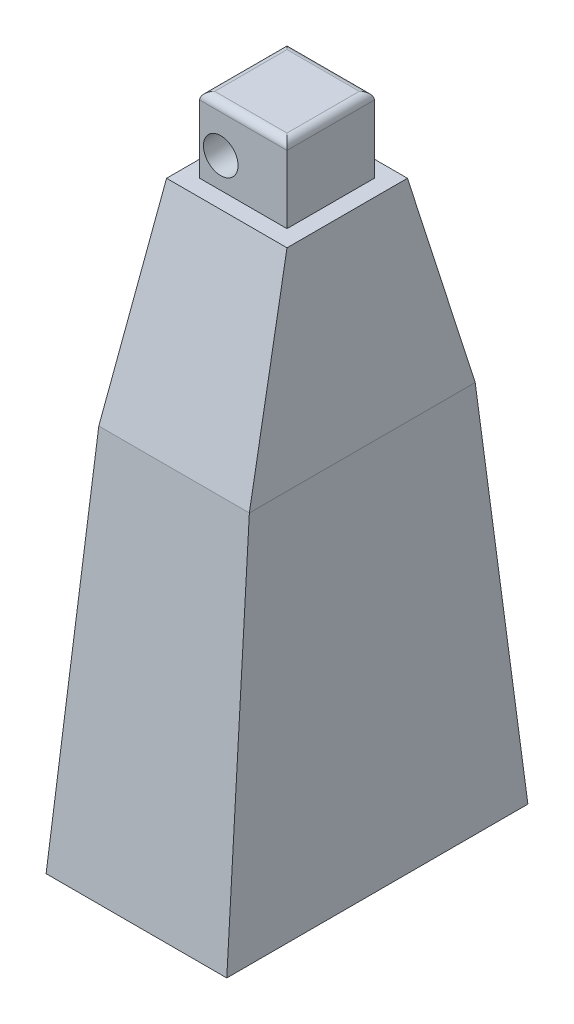
ISO-10303-21;
HEADER;
FILE_DESCRIPTION(('STEP AP214'),'2;1');
FILE_NAME('part.step','',(''),(''),'','','');
FILE_SCHEMA(('AUTOMOTIVE_DESIGN { 1 0 10303 214 1 1 1 1 }'));
ENDSEC;
DATA;
#1=APPLICATION_CONTEXT('core data for automotive mechanical design processes');
#2=APPLICATION_PROTOCOL_DEFINITION('international standard','automotive_design',2000,#1);
#3=PRODUCT_CONTEXT('',#1,'mechanical');
#4=PRODUCT('Part','Part','',(#3));
#5=PRODUCT_RELATED_PRODUCT_CATEGORY('part','',(#4));
#6=PRODUCT_DEFINITION_FORMATION('','',#4);
#7=PRODUCT_DEFINITION_CONTEXT('part definition',#1,'design');
#8=PRODUCT_DEFINITION('design','',#6,#7);
#9=PRODUCT_DEFINITION_SHAPE('','',#8);
#10=(LENGTH_UNIT() NAMED_UNIT(*) SI_UNIT(.MILLI.,.METRE.));
#11=(NAMED_UNIT(*) PLANE_ANGLE_UNIT() SI_UNIT($,.RADIAN.));
#12=(NAMED_UNIT(*) SI_UNIT($,.STERADIAN.) SOLID_ANGLE_UNIT());
#13=UNCERTAINTY_MEASURE_WITH_UNIT(LENGTH_MEASURE(1.E-05),#10,'distance_accuracy_value','');
#14=(GEOMETRIC_REPRESENTATION_CONTEXT(3) GLOBAL_UNCERTAINTY_ASSIGNED_CONTEXT((#13)) GLOBAL_UNIT_ASSIGNED_CONTEXT((#10,
#11,#12)) REPRESENTATION_CONTEXT('',''));
#15=CARTESIAN_POINT('',(0.,0.,0.));
#16=DIRECTION('',(0.,0.,1.));
#17=DIRECTION('',(1.,0.,0.));
#18=AXIS2_PLACEMENT_3D('',#15,#16,#17);
#19=CARTESIAN_POINT('',(0.,76.,0.));
#20=DIRECTION('',(0.,-1.,0.));
#21=DIRECTION('',(0.,0.,-1.));
#22=AXIS2_PLACEMENT_3D('',#19,#20,#21);
#23=PLANE('',#22);
#24=DIRECTION('',(0.,0.,1.));
#25=VECTOR('',#24,1.);
#26=CARTESIAN_POINT('',(-8.,76.,-8.));
#27=LINE('',#26,#25);
#28=CARTESIAN_POINT('',(-8.,76.,-8.));
#29=VERTEX_POINT('',#28);
#30=CARTESIAN_POINT('',(-8.,76.,8.));
#31=VERTEX_POINT('',#30);
#32=EDGE_CURVE('E261',#29,#31,#27,.T.);
#33=ORIENTED_EDGE('',*,*,#32,.T.);
#34=DIRECTION('',(1.,0.,0.));
#35=VECTOR('',#34,1.);
#36=CARTESIAN_POINT('',(8.,76.,8.));
#37=LINE('',#36,#35);
#38=CARTESIAN_POINT('',(8.,76.,8.));
#39=VERTEX_POINT('',#38);
#40=EDGE_CURVE('E309',#31,#39,#37,.T.);
#41=ORIENTED_EDGE('',*,*,#40,.T.);
#42=DIRECTION('',(0.,0.,-1.));
#43=VECTOR('',#42,1.);
#44=CARTESIAN_POINT('',(8.,76.,-8.));
#45=LINE('',#44,#43);
#46=CARTESIAN_POINT('',(8.,76.,-8.));
#47=VERTEX_POINT('',#46);
#48=EDGE_CURVE('E321',#39,#47,#45,.T.);
#49=ORIENTED_EDGE('',*,*,#48,.T.);
#50=DIRECTION('',(-1.,0.,0.));
#51=VECTOR('',#50,1.);
#52=CARTESIAN_POINT('',(8.,76.,-8.));
#53=LINE('',#52,#51);
#54=EDGE_CURVE('E268',#47,#29,#53,.T.);
#55=ORIENTED_EDGE('',*,*,#54,.T.);
#56=EDGE_LOOP('',(#33,#41,#49,#55));
#57=FACE_BOUND('',#56,.T.);
#58=DIRECTION('',(1.,0.,0.));
#59=VECTOR('',#58,1.);
#60=CARTESIAN_POINT('',(-5.8,76.,5.8));
#61=LINE('',#60,#59);
#62=CARTESIAN_POINT('',(-5.8,76.,5.8));
#63=VERTEX_POINT('',#62);
#64=CARTESIAN_POINT('',(5.8,76.,5.8));
#65=VERTEX_POINT('',#64);
#66=EDGE_CURVE('E222',#63,#65,#61,.T.);
#67=ORIENTED_EDGE('',*,*,#66,.F.);
#68=DIRECTION('',(0.,0.,1.));
#69=VECTOR('',#68,1.);
#70=CARTESIAN_POINT('',(-5.8,76.,-5.8));
#71=LINE('',#70,#69);
#72=CARTESIAN_POINT('',(-5.8,76.,-5.8));
#73=VERTEX_POINT('',#72);
#74=EDGE_CURVE('E233',#73,#63,#71,.T.);
#75=ORIENTED_EDGE('',*,*,#74,.F.);
#76=DIRECTION('',(-1.,0.,0.));
#77=VECTOR('',#76,1.);
#78=CARTESIAN_POINT('',(5.8,76.,-5.8));
#79=LINE('',#78,#77);
#80=CARTESIAN_POINT('',(5.8,76.,-5.8));
#81=VERTEX_POINT('',#80);
#82=EDGE_CURVE('E230',#81,#73,#79,.T.);
#83=ORIENTED_EDGE('',*,*,#82,.F.);
#84=DIRECTION('',(0.,0.,-1.));
#85=VECTOR('',#84,1.);
#86=CARTESIAN_POINT('',(5.8,76.,5.8));
#87=LINE('',#86,#85);
#88=EDGE_CURVE('E227',#65,#81,#87,.T.);
#89=ORIENTED_EDGE('',*,*,#88,.F.);
#90=EDGE_LOOP('',(#67,#75,#83,#89));
#91=FACE_BOUND('',#90,.T.);
#92=ADVANCED_FACE('F55',(#57,#91),#23,.F.);
#93=CARTESIAN_POINT('',(0.,0.,0.));
#94=DIRECTION('',(0.,1.,0.));
#95=DIRECTION('',(0.,0.,1.));
#96=AXIS2_PLACEMENT_3D('',#93,#94,#95);
#97=PLANE('',#96);
#98=CARTESIAN_POINT('',(0.,0.,16.));
#99=DIRECTION('',(0.,-1.,0.));
#100=DIRECTION('',(0.,0.,-1.));
#101=AXIS2_PLACEMENT_3D('',#98,#99,#100);
#102=CIRCLE('',#101,2.3);
#103=CARTESIAN_POINT('',(0.,0.,13.7));
#104=VERTEX_POINT('',#103);
#105=EDGE_CURVE('E863',#104,#104,#102,.T.);
#106=ORIENTED_EDGE('',*,*,#105,.F.);
#107=EDGE_LOOP('',(#106));
#108=FACE_BOUND('',#107,.T.);
#109=CARTESIAN_POINT('',(0.,0.,-16.));
#110=DIRECTION('',(0.,-1.,0.));
#111=DIRECTION('',(0.,0.,1.));
#112=AXIS2_PLACEMENT_3D('',#109,#110,#111);
#113=CIRCLE('',#112,2.3);
#114=CARTESIAN_POINT('',(0.,0.,-13.7));
#115=VERTEX_POINT('',#114);
#116=EDGE_CURVE('E195',#115,#115,#113,.T.);
#117=ORIENTED_EDGE('',*,*,#116,.F.);
#118=EDGE_LOOP('',(#117));
#119=FACE_BOUND('',#118,.T.);
#120=DIRECTION('',(1.,0.,0.));
#121=VECTOR('',#120,1.);
#122=CARTESIAN_POINT('',(-4.2,0.,-12.2));
#123=LINE('',#122,#121);
#124=CARTESIAN_POINT('',(-4.2,0.,-12.2));
#125=VERTEX_POINT('',#124);
#126=CARTESIAN_POINT('',(4.2,0.,-12.2));
#127=VERTEX_POINT('',#126);
#128=EDGE_CURVE('E201',#125,#127,#123,.T.);
#129=ORIENTED_EDGE('',*,*,#128,.F.);
#130=DIRECTION('',(0.,0.,-1.));
#131=VECTOR('',#130,1.);
#132=CARTESIAN_POINT('',(-4.2,0.,12.2));
#133=LINE('',#132,#131);
#134=CARTESIAN_POINT('',(-4.2,0.,12.2));
#135=VERTEX_POINT('',#134);
#136=EDGE_CURVE('E72',#135,#125,#133,.T.);
#137=ORIENTED_EDGE('',*,*,#136,.F.);
#138=DIRECTION('',(-1.,0.,0.));
#139=VECTOR('',#138,1.);
#140=CARTESIAN_POINT('',(4.2,0.,12.2));
#141=LINE('',#140,#139);
#142=CARTESIAN_POINT('',(4.2,0.,12.2));
#143=VERTEX_POINT('',#142);
#144=EDGE_CURVE('E189',#143,#135,#141,.T.);
#145=ORIENTED_EDGE('',*,*,#144,.F.);
#146=DIRECTION('',(0.,0.,1.));
#147=VECTOR('',#146,1.);
#148=CARTESIAN_POINT('',(4.2,0.,-12.2));
#149=LINE('',#148,#147);
#150=EDGE_CURVE('E192',#127,#143,#149,.T.);
#151=ORIENTED_EDGE('',*,*,#150,.F.);
#152=EDGE_LOOP('',(#129,#137,#145,#151));
#153=FACE_BOUND('',#152,.T.);
#154=DIRECTION('',(0.,0.,-1.));
#155=VECTOR('',#154,1.);
#156=CARTESIAN_POINT('',(12.,0.,-20.));
#157=LINE('',#156,#155);
#158=CARTESIAN_POINT('',(12.,0.,20.));
#159=VERTEX_POINT('',#158);
#160=CARTESIAN_POINT('',(12.,0.,-20.));
#161=VERTEX_POINT('',#160);
#162=EDGE_CURVE('E518',#159,#161,#157,.T.);
#163=ORIENTED_EDGE('',*,*,#162,.F.);
#164=DIRECTION('',(1.,0.,0.));
#165=VECTOR('',#164,1.);
#166=CARTESIAN_POINT('',(-12.,0.,20.));
#167=LINE('',#166,#165);
#168=CARTESIAN_POINT('',(-12.,0.,20.));
#169=VERTEX_POINT('',#168);
#170=EDGE_CURVE('E511',#169,#159,#167,.T.);
#171=ORIENTED_EDGE('',*,*,#170,.F.);
#172=DIRECTION('',(0.,0.,1.));
#173=VECTOR('',#172,1.);
#174=CARTESIAN_POINT('',(-12.,0.,-20.));
#175=LINE('',#174,#173);
#176=CARTESIAN_POINT('',(-12.,0.,-20.));
#177=VERTEX_POINT('',#176);
#178=EDGE_CURVE('E517',#177,#169,#175,.T.);
#179=ORIENTED_EDGE('',*,*,#178,.F.);
#180=DIRECTION('',(-1.,0.,0.));
#181=VECTOR('',#180,1.);
#182=CARTESIAN_POINT('',(-12.,0.,-20.));
#183=LINE('',#182,#181);
#184=EDGE_CURVE('E521',#161,#177,#183,.T.);
#185=ORIENTED_EDGE('',*,*,#184,.F.);
#186=EDGE_LOOP('',(#163,#171,#179,#185));
#187=FACE_BOUND('',#186,.T.);
#188=ADVANCED_FACE('F406',(#108,#119,#153,#187),#97,.F.);
#189=CARTESIAN_POINT('',(0.,1.98019801980198,-19.8019801980198));
#190=DIRECTION('',(0.,-0.099503719020999,0.995037190209989));
#191=DIRECTION('',(0.,-0.995037190209989,-0.099503719020999));
#192=AXIS2_PLACEMENT_3D('',#189,#190,#191);
#193=PLANE('',#192);
#194=DIRECTION('',(0.039769999084793,0.994249977119823,0.0994249977119823));
#195=VECTOR('',#194,1.);
#196=CARTESIAN_POINT('',(-12.,0.,-20.));
#197=LINE('',#196,#195);
#198=CARTESIAN_POINT('',(-10.,50.,-15.));
#199=VERTEX_POINT('',#198);
#200=EDGE_CURVE('E533',#177,#199,#197,.T.);
#201=ORIENTED_EDGE('',*,*,#200,.T.);
#202=DIRECTION('',(-1.,0.,0.));
#203=VECTOR('',#202,1.);
#204=CARTESIAN_POINT('',(10.,50.,-15.));
#205=LINE('',#204,#203);
#206=CARTESIAN_POINT('',(10.,50.,-15.));
#207=VERTEX_POINT('',#206);
#208=EDGE_CURVE('E457',#207,#199,#205,.T.);
#209=ORIENTED_EDGE('',*,*,#208,.F.);
#210=DIRECTION('',(-0.0397699990847928,0.994249977119823,0.0994249977119823));
#211=VECTOR('',#210,1.);
#212=CARTESIAN_POINT('',(12.,0.,-20.));
#213=LINE('',#212,#211);
#214=EDGE_CURVE('E539',#161,#207,#213,.T.);
#215=ORIENTED_EDGE('',*,*,#214,.F.);
#216=ORIENTED_EDGE('',*,*,#184,.T.);
#217=EDGE_LOOP('',(#201,#209,#215,#216));
#218=FACE_BOUND('',#217,.T.);
#219=ADVANCED_FACE('F411',(#218),#193,.F.);
#220=CARTESIAN_POINT('',(11.9808306709265,0.47923322683706,0.));
#221=DIRECTION('',(-0.999200958721789,-0.0399680383488715,0.));
#222=DIRECTION('',(0.0399680383488715,-0.999200958721789,0.));
#223=AXIS2_PLACEMENT_3D('',#220,#221,#222);
#224=PLANE('',#223);
#225=ORIENTED_EDGE('',*,*,#214,.T.);
#226=DIRECTION('',(0.,0.,-1.));
#227=VECTOR('',#226,1.);
#228=CARTESIAN_POINT('',(10.,50.,-15.));
#229=LINE('',#228,#227);
#230=CARTESIAN_POINT('',(10.,50.,15.));
#231=VERTEX_POINT('',#230);
#232=EDGE_CURVE('E469',#231,#207,#229,.T.);
#233=ORIENTED_EDGE('',*,*,#232,.F.);
#234=DIRECTION('',(-0.0397699990847929,0.994249977119823,-0.0994249977119822));
#235=VECTOR('',#234,1.);
#236=CARTESIAN_POINT('',(12.,0.,20.));
#237=LINE('',#236,#235);
#238=EDGE_CURVE('E464',#159,#231,#237,.T.);
#239=ORIENTED_EDGE('',*,*,#238,.F.);
#240=ORIENTED_EDGE('',*,*,#162,.T.);
#241=EDGE_LOOP('',(#225,#233,#239,#240));
#242=FACE_BOUND('',#241,.T.);
#243=ADVANCED_FACE('F538',(#242),#224,.F.);
#244=CARTESIAN_POINT('',(-11.9808306709265,0.479233226837061,0.));
#245=DIRECTION('',(0.999200958721789,-0.0399680383488716,0.));
#246=DIRECTION('',(0.0399680383488716,0.999200958721789,0.));
#247=AXIS2_PLACEMENT_3D('',#244,#245,#246);
#248=PLANE('',#247);
#249=DIRECTION('',(0.0397699990847929,0.994249977119823,-0.0994249977119822));
#250=VECTOR('',#249,1.);
#251=CARTESIAN_POINT('',(-12.,0.,20.));
#252=LINE('',#251,#250);
#253=CARTESIAN_POINT('',(-9.99999999999999,50.,15.));
#254=VERTEX_POINT('',#253);
#255=EDGE_CURVE('E543',#169,#254,#252,.T.);
#256=ORIENTED_EDGE('',*,*,#255,.T.);
#257=DIRECTION('',(0.,0.,1.));
#258=VECTOR('',#257,1.);
#259=CARTESIAN_POINT('',(-10.,50.,-15.));
#260=LINE('',#259,#258);
#261=EDGE_CURVE('E460',#199,#254,#260,.T.);
#262=ORIENTED_EDGE('',*,*,#261,.F.);
#263=ORIENTED_EDGE('',*,*,#200,.F.);
#264=ORIENTED_EDGE('',*,*,#178,.T.);
#265=EDGE_LOOP('',(#256,#262,#263,#264));
#266=FACE_BOUND('',#265,.T.);
#267=ADVANCED_FACE('F563',(#266),#248,.F.);
#268=CARTESIAN_POINT('',(0.,1.98019801980198,19.8019801980198));
#269=DIRECTION('',(0.,-0.0995037190209989,-0.995037190209989));
#270=DIRECTION('',(0.,0.995037190209989,-0.0995037190209989));
#271=AXIS2_PLACEMENT_3D('',#268,#269,#270);
#272=PLANE('',#271);
#273=ORIENTED_EDGE('',*,*,#238,.T.);
#274=DIRECTION('',(1.,0.,0.));
#275=VECTOR('',#274,1.);
#276=CARTESIAN_POINT('',(10.,50.,15.));
#277=LINE('',#276,#275);
#278=EDGE_CURVE('E463',#254,#231,#277,.T.);
#279=ORIENTED_EDGE('',*,*,#278,.F.);
#280=ORIENTED_EDGE('',*,*,#255,.F.);
#281=ORIENTED_EDGE('',*,*,#170,.T.);
#282=EDGE_LOOP('',(#273,#279,#280,#281));
#283=FACE_BOUND('',#282,.T.);
#284=ADVANCED_FACE('F336',(#283),#272,.F.);
#285=CARTESIAN_POINT('',(13.764705882353,1.05882352941177,0.));
#286=DIRECTION('',(-0.997054485501582,-0.0766964988847372,0.));
#287=DIRECTION('',(0.0766964988847372,-0.997054485501582,0.));
#288=AXIS2_PLACEMENT_3D('',#285,#286,#287);
#289=PLANE('',#288);
#290=DIRECTION('',(-0.0740740740740742,0.962962962962963,0.259259259259259));
#291=VECTOR('',#290,1.);
#292=CARTESIAN_POINT('',(10.,50.,-15.));
#293=LINE('',#292,#291);
#294=EDGE_CURVE('E244',#207,#47,#293,.T.);
#295=ORIENTED_EDGE('',*,*,#294,.T.);
#296=ORIENTED_EDGE('',*,*,#48,.F.);
#297=DIRECTION('',(-0.0740740740740743,0.962962962962963,-0.259259259259259));
#298=VECTOR('',#297,1.);
#299=CARTESIAN_POINT('',(10.,50.,15.));
#300=LINE('',#299,#298);
#301=EDGE_CURVE('E245',#231,#39,#300,.T.);
#302=ORIENTED_EDGE('',*,*,#301,.F.);
#303=ORIENTED_EDGE('',*,*,#232,.T.);
#304=EDGE_LOOP('',(#295,#296,#302,#303));
#305=FACE_BOUND('',#304,.T.);
#306=ADVANCED_FACE('F327',(#305),#289,.F.);
#307=CARTESIAN_POINT('',(0.,7.1448275862069,26.5379310344828));
#308=DIRECTION('',(0.,-0.259973473447873,-0.96561575852067));
#309=DIRECTION('',(0.,0.96561575852067,-0.259973473447873));
#310=AXIS2_PLACEMENT_3D('',#307,#308,#309);
#311=PLANE('',#310);
#312=ORIENTED_EDGE('',*,*,#301,.T.);
#313=ORIENTED_EDGE('',*,*,#40,.F.);
#314=DIRECTION('',(0.0740740740740739,0.962962962962963,-0.259259259259259));
#315=VECTOR('',#314,1.);
#316=CARTESIAN_POINT('',(-9.99999999999999,50.,15.));
#317=LINE('',#316,#315);
#318=EDGE_CURVE('E256',#254,#31,#317,.T.);
#319=ORIENTED_EDGE('',*,*,#318,.F.);
#320=ORIENTED_EDGE('',*,*,#278,.T.);
#321=EDGE_LOOP('',(#312,#313,#319,#320));
#322=FACE_BOUND('',#321,.T.);
#323=ADVANCED_FACE('F287',(#322),#311,.F.);
#324=CARTESIAN_POINT('',(0.,7.1448275862069,-26.5379310344828));
#325=DIRECTION('',(0.,-0.259973473447873,0.96561575852067));
#326=DIRECTION('',(0.,-0.96561575852067,-0.259973473447873));
#327=AXIS2_PLACEMENT_3D('',#324,#325,#326);
#328=PLANE('',#327);
#329=DIRECTION('',(0.074074074074074,0.962962962962963,0.259259259259259));
#330=VECTOR('',#329,1.);
#331=CARTESIAN_POINT('',(-10.,50.,-15.));
#332=LINE('',#331,#330);
#333=EDGE_CURVE('E248',#199,#29,#332,.T.);
#334=ORIENTED_EDGE('',*,*,#333,.T.);
#335=ORIENTED_EDGE('',*,*,#54,.F.);
#336=ORIENTED_EDGE('',*,*,#294,.F.);
#337=ORIENTED_EDGE('',*,*,#208,.T.);
#338=EDGE_LOOP('',(#334,#335,#336,#337));
#339=FACE_BOUND('',#338,.T.);
#340=ADVANCED_FACE('F276',(#339),#328,.F.);
#341=CARTESIAN_POINT('',(-13.7647058823529,1.05882352941176,0.));
#342=DIRECTION('',(0.997054485501582,-0.0766964988847369,0.));
#343=DIRECTION('',(0.0766964988847369,0.997054485501582,0.));
#344=AXIS2_PLACEMENT_3D('',#341,#342,#343);
#345=PLANE('',#344);
#346=ORIENTED_EDGE('',*,*,#318,.T.);
#347=ORIENTED_EDGE('',*,*,#32,.F.);
#348=ORIENTED_EDGE('',*,*,#333,.F.);
#349=ORIENTED_EDGE('',*,*,#261,.T.);
#350=EDGE_LOOP('',(#346,#347,#348,#349));
#351=FACE_BOUND('',#350,.T.);
#352=ADVANCED_FACE('F286',(#351),#345,.F.);
#353=CARTESIAN_POINT('',(-5.8,86.,5.8));
#354=DIRECTION('',(0.,0.,-1.));
#355=DIRECTION('',(-1.,0.,0.));
#356=AXIS2_PLACEMENT_3D('',#353,#354,#355);
#357=PLANE('',#356);
#358=CARTESIAN_POINT('',(-3.,80.,5.8));
#359=DIRECTION('',(0.,0.,1.));
#360=DIRECTION('',(1.,0.,0.));
#361=AXIS2_PLACEMENT_3D('',#358,#359,#360);
#362=CIRCLE('',#361,2.3);
#363=CARTESIAN_POINT('',(-0.699999999999999,80.,5.8));
#364=VERTEX_POINT('',#363);
#365=EDGE_CURVE('E215',#364,#364,#362,.T.);
#366=ORIENTED_EDGE('',*,*,#365,.F.);
#367=EDGE_LOOP('',(#366));
#368=FACE_BOUND('',#367,.T.);
#369=DIRECTION('',(0.,-1.,0.));
#370=VECTOR('',#369,1.);
#371=CARTESIAN_POINT('',(5.8,86.,5.8));
#372=LINE('',#371,#370);
#373=CARTESIAN_POINT('',(5.8,85.,5.8));
#374=VERTEX_POINT('',#373);
#375=EDGE_CURVE('E242',#374,#65,#372,.T.);
#376=ORIENTED_EDGE('',*,*,#375,.F.);
#377=DIRECTION('',(1.,0.,0.));
#378=VECTOR('',#377,1.);
#379=CARTESIAN_POINT('',(-5.8,85.,5.8));
#380=LINE('',#379,#378);
#381=CARTESIAN_POINT('',(-5.8,85.,5.8));
#382=VERTEX_POINT('',#381);
#383=EDGE_CURVE('E447',#374,#382,#380,.F.);
#384=ORIENTED_EDGE('',*,*,#383,.T.);
#385=DIRECTION('',(0.,-1.,0.));
#386=VECTOR('',#385,1.);
#387=CARTESIAN_POINT('',(-5.8,86.,5.8));
#388=LINE('',#387,#386);
#389=EDGE_CURVE('E236',#382,#63,#388,.T.);
#390=ORIENTED_EDGE('',*,*,#389,.T.);
#391=ORIENTED_EDGE('',*,*,#66,.T.);
#392=EDGE_LOOP('',(#376,#384,#390,#391));
#393=FACE_BOUND('',#392,.T.);
#394=ADVANCED_FACE('F293',(#368,#393),#357,.F.);
#395=CARTESIAN_POINT('',(5.8,86.,5.8));
#396=DIRECTION('',(-1.,0.,0.));
#397=DIRECTION('',(0.,0.,1.));
#398=AXIS2_PLACEMENT_3D('',#395,#396,#397);
#399=PLANE('',#398);
#400=DIRECTION('',(0.,-1.,0.));
#401=VECTOR('',#400,1.);
#402=CARTESIAN_POINT('',(5.8,86.,-5.8));
#403=LINE('',#402,#401);
#404=CARTESIAN_POINT('',(5.8,85.,-5.8));
#405=VERTEX_POINT('',#404);
#406=EDGE_CURVE('E240',#405,#81,#403,.T.);
#407=ORIENTED_EDGE('',*,*,#406,.F.);
#408=DIRECTION('',(0.,0.,-1.));
#409=VECTOR('',#408,1.);
#410=CARTESIAN_POINT('',(5.8,85.,5.8));
#411=LINE('',#410,#409);
#412=EDGE_CURVE('E12',#405,#374,#411,.F.);
#413=ORIENTED_EDGE('',*,*,#412,.T.);
#414=ORIENTED_EDGE('',*,*,#375,.T.);
#415=ORIENTED_EDGE('',*,*,#88,.T.);
#416=EDGE_LOOP('',(#407,#413,#414,#415));
#417=FACE_BOUND('',#416,.T.);
#418=ADVANCED_FACE('F339',(#417),#399,.F.);
#419=CARTESIAN_POINT('',(5.8,86.,-5.8));
#420=DIRECTION('',(0.,0.,1.));
#421=DIRECTION('',(1.,0.,0.));
#422=AXIS2_PLACEMENT_3D('',#419,#420,#421);
#423=PLANE('',#422);
#424=CARTESIAN_POINT('',(3.,80.,-5.8));
#425=DIRECTION('',(0.,0.,-1.));
#426=DIRECTION('',(-1.,0.,0.));
#427=AXIS2_PLACEMENT_3D('',#424,#425,#426);
#428=CIRCLE('',#427,2.3);
#429=CARTESIAN_POINT('',(0.699999999999999,80.,-5.8));
#430=VERTEX_POINT('',#429);
#431=EDGE_CURVE('E216',#430,#430,#428,.T.);
#432=ORIENTED_EDGE('',*,*,#431,.F.);
#433=EDGE_LOOP('',(#432));
#434=FACE_BOUND('',#433,.T.);
#435=DIRECTION('',(0.,-1.,0.));
#436=VECTOR('',#435,1.);
#437=CARTESIAN_POINT('',(-5.8,86.,-5.8));
#438=LINE('',#437,#436);
#439=CARTESIAN_POINT('',(-5.8,85.,-5.8));
#440=VERTEX_POINT('',#439);
#441=EDGE_CURVE('E238',#440,#73,#438,.T.);
#442=ORIENTED_EDGE('',*,*,#441,.F.);
#443=DIRECTION('',(-1.,0.,0.));
#444=VECTOR('',#443,1.);
#445=CARTESIAN_POINT('',(5.8,85.,-5.8));
#446=LINE('',#445,#444);
#447=EDGE_CURVE('E64',#440,#405,#446,.F.);
#448=ORIENTED_EDGE('',*,*,#447,.T.);
#449=ORIENTED_EDGE('',*,*,#406,.T.);
#450=ORIENTED_EDGE('',*,*,#82,.T.);
#451=EDGE_LOOP('',(#442,#448,#449,#450));
#452=FACE_BOUND('',#451,.T.);
#453=ADVANCED_FACE('F343',(#434,#452),#423,.F.);
#454=CARTESIAN_POINT('',(-5.8,86.,-5.8));
#455=DIRECTION('',(1.,0.,0.));
#456=DIRECTION('',(0.,0.,-1.));
#457=AXIS2_PLACEMENT_3D('',#454,#455,#456);
#458=PLANE('',#457);
#459=ORIENTED_EDGE('',*,*,#389,.F.);
#460=DIRECTION('',(0.,0.,1.));
#461=VECTOR('',#460,1.);
#462=CARTESIAN_POINT('',(-5.8,85.,-5.8));
#463=LINE('',#462,#461);
#464=EDGE_CURVE('E424',#382,#440,#463,.F.);
#465=ORIENTED_EDGE('',*,*,#464,.T.);
#466=ORIENTED_EDGE('',*,*,#441,.T.);
#467=ORIENTED_EDGE('',*,*,#74,.T.);
#468=EDGE_LOOP('',(#459,#465,#466,#467));
#469=FACE_BOUND('',#468,.T.);
#470=ADVANCED_FACE('F347',(#469),#458,.F.);
#471=CARTESIAN_POINT('',(0.,86.,0.));
#472=DIRECTION('',(0.,1.,0.));
#473=DIRECTION('',(0.,0.,1.));
#474=AXIS2_PLACEMENT_3D('',#471,#472,#473);
#475=PLANE('',#474);
#476=DIRECTION('',(0.,0.,1.));
#477=VECTOR('',#476,1.);
#478=CARTESIAN_POINT('',(-4.8,86.,5.8));
#479=LINE('',#478,#477);
#480=CARTESIAN_POINT('',(-4.8,86.,-4.8));
#481=VERTEX_POINT('',#480);
#482=CARTESIAN_POINT('',(-4.8,86.,4.8));
#483=VERTEX_POINT('',#482);
#484=EDGE_CURVE('E439',#481,#483,#479,.T.);
#485=ORIENTED_EDGE('',*,*,#484,.T.);
#486=DIRECTION('',(1.,0.,0.));
#487=VECTOR('',#486,1.);
#488=CARTESIAN_POINT('',(5.8,86.,4.8));
#489=LINE('',#488,#487);
#490=CARTESIAN_POINT('',(4.8,86.,4.8));
#491=VERTEX_POINT('',#490);
#492=EDGE_CURVE('E449',#483,#491,#489,.T.);
#493=ORIENTED_EDGE('',*,*,#492,.T.);
#494=DIRECTION('',(0.,0.,-1.));
#495=VECTOR('',#494,1.);
#496=CARTESIAN_POINT('',(4.8,86.,-5.8));
#497=LINE('',#496,#495);
#498=CARTESIAN_POINT('',(4.8,86.,-4.8));
#499=VERTEX_POINT('',#498);
#500=EDGE_CURVE('E455',#491,#499,#497,.T.);
#501=ORIENTED_EDGE('',*,*,#500,.T.);
#502=DIRECTION('',(-1.,0.,0.));
#503=VECTOR('',#502,1.);
#504=CARTESIAN_POINT('',(-5.8,86.,-4.8));
#505=LINE('',#504,#503);
#506=EDGE_CURVE('E453',#499,#481,#505,.T.);
#507=ORIENTED_EDGE('',*,*,#506,.T.);
#508=EDGE_LOOP('',(#485,#493,#501,#507));
#509=FACE_BOUND('',#508,.T.);
#510=ADVANCED_FACE('F351',(#509),#475,.T.);
#511=CARTESIAN_POINT('',(-3.,80.,-0.200000000000001));
#512=DIRECTION('',(0.,0.,1.));
#513=DIRECTION('',(1.,0.,0.));
#514=AXIS2_PLACEMENT_3D('',#511,#512,#513);
#515=CYLINDRICAL_SURFACE('',#514,2.3);
#516=CARTESIAN_POINT('',(-3.,80.,-0.200000000000001));
#517=DIRECTION('',(0.,0.,1.));
#518=DIRECTION('',(1.,0.,0.));
#519=AXIS2_PLACEMENT_3D('',#516,#517,#518);
#520=CIRCLE('',#519,2.3);
#521=CARTESIAN_POINT('',(-0.699999999999999,80.,-0.200000000000001));
#522=VERTEX_POINT('',#521);
#523=EDGE_CURVE('E219',#522,#522,#520,.T.);
#524=ORIENTED_EDGE('',*,*,#523,.F.);
#525=EDGE_LOOP('',(#524));
#526=FACE_BOUND('',#525,.T.);
#527=ORIENTED_EDGE('',*,*,#365,.T.);
#528=EDGE_LOOP('',(#527));
#529=FACE_BOUND('',#528,.T.);
#530=ADVANCED_FACE('F355',(#526,#529),#515,.F.);
#531=CARTESIAN_POINT('',(-3.,80.,-0.200000000000001));
#532=DIRECTION('',(0.,0.,1.));
#533=DIRECTION('',(1.,0.,0.));
#534=AXIS2_PLACEMENT_3D('',#531,#532,#533);
#535=PLANE('',#534);
#536=ORIENTED_EDGE('',*,*,#523,.T.);
#537=EDGE_LOOP('',(#536));
#538=FACE_BOUND('',#537,.T.);
#539=ADVANCED_FACE('F359',(#538),#535,.T.);
#540=CARTESIAN_POINT('',(3.,80.,0.199999999999999));
#541=DIRECTION('',(0.,0.,-1.));
#542=DIRECTION('',(-1.,0.,0.));
#543=AXIS2_PLACEMENT_3D('',#540,#541,#542);
#544=CYLINDRICAL_SURFACE('',#543,2.3);
#545=CARTESIAN_POINT('',(3.,80.,0.199999999999999));
#546=DIRECTION('',(0.,0.,-1.));
#547=DIRECTION('',(-1.,0.,0.));
#548=AXIS2_PLACEMENT_3D('',#545,#546,#547);
#549=CIRCLE('',#548,2.3);
#550=CARTESIAN_POINT('',(0.7,80.,0.199999999999999));
#551=VERTEX_POINT('',#550);
#552=EDGE_CURVE('E212',#551,#551,#549,.T.);
#553=ORIENTED_EDGE('',*,*,#552,.F.);
#554=EDGE_LOOP('',(#553));
#555=FACE_BOUND('',#554,.T.);
#556=ORIENTED_EDGE('',*,*,#431,.T.);
#557=EDGE_LOOP('',(#556));
#558=FACE_BOUND('',#557,.T.);
#559=ADVANCED_FACE('F363',(#555,#558),#544,.F.);
#560=CARTESIAN_POINT('',(3.,80.,0.199999999999999));
#561=DIRECTION('',(0.,0.,-1.));
#562=DIRECTION('',(-1.,0.,0.));
#563=AXIS2_PLACEMENT_3D('',#560,#561,#562);
#564=PLANE('',#563);
#565=ORIENTED_EDGE('',*,*,#552,.T.);
#566=EDGE_LOOP('',(#565));
#567=FACE_BOUND('',#566,.T.);
#568=ADVANCED_FACE('F367',(#567),#564,.T.);
#569=CARTESIAN_POINT('',(0.,85.,-4.8));
#570=DIRECTION('',(1.,0.,0.));
#571=DIRECTION('',(0.,0.,-1.));
#572=AXIS2_PLACEMENT_3D('',#569,#570,#571);
#573=CYLINDRICAL_SURFACE('',#572,1.);
#574=CARTESIAN_POINT('',(4.8,85.,-4.8));
#575=DIRECTION('',(0.707106781186548,0.,0.707106781186547));
#576=DIRECTION('',(-0.707106781186547,0.,0.707106781186548));
#577=AXIS2_PLACEMENT_3D('',#574,#575,#576);
#578=ELLIPSE('',#577,1.41421356237309,1.);
#579=EDGE_CURVE('E432',#405,#499,#578,.T.);
#580=ORIENTED_EDGE('',*,*,#579,.F.);
#581=ORIENTED_EDGE('',*,*,#447,.F.);
#582=CARTESIAN_POINT('',(-4.8,85.,-4.8));
#583=DIRECTION('',(0.707106781186547,0.,-0.707106781186548));
#584=DIRECTION('',(0.707106781186548,0.,0.707106781186547));
#585=AXIS2_PLACEMENT_3D('',#582,#583,#584);
#586=ELLIPSE('',#585,1.41421356237309,1.);
#587=EDGE_CURVE('E59',#481,#440,#586,.F.);
#588=ORIENTED_EDGE('',*,*,#587,.F.);
#589=ORIENTED_EDGE('',*,*,#506,.F.);
#590=EDGE_LOOP('',(#580,#581,#588,#589));
#591=FACE_BOUND('',#590,.T.);
#592=ADVANCED_FACE('F57',(#591),#573,.T.);
#593=CARTESIAN_POINT('',(-4.8,85.,0.));
#594=DIRECTION('',(0.,0.,-1.));
#595=DIRECTION('',(-1.,0.,0.));
#596=AXIS2_PLACEMENT_3D('',#593,#594,#595);
#597=CYLINDRICAL_SURFACE('',#596,1.);
#598=ORIENTED_EDGE('',*,*,#587,.T.);
#599=ORIENTED_EDGE('',*,*,#464,.F.);
#600=CARTESIAN_POINT('',(-4.8,85.,4.8));
#601=DIRECTION('',(-0.707106781186548,0.,-0.707106781186547));
#602=DIRECTION('',(0.707106781186547,0.,-0.707106781186548));
#603=AXIS2_PLACEMENT_3D('',#600,#601,#602);
#604=ELLIPSE('',#603,1.41421356237309,1.);
#605=EDGE_CURVE('E440',#483,#382,#604,.F.);
#606=ORIENTED_EDGE('',*,*,#605,.F.);
#607=ORIENTED_EDGE('',*,*,#484,.F.);
#608=EDGE_LOOP('',(#598,#599,#606,#607));
#609=FACE_BOUND('',#608,.T.);
#610=ADVANCED_FACE('F436',(#609),#597,.T.);
#611=CARTESIAN_POINT('',(4.8,85.,0.));
#612=DIRECTION('',(0.,0.,1.));
#613=DIRECTION('',(1.,0.,0.));
#614=AXIS2_PLACEMENT_3D('',#611,#612,#613);
#615=CYLINDRICAL_SURFACE('',#614,1.);
#616=ORIENTED_EDGE('',*,*,#579,.T.);
#617=ORIENTED_EDGE('',*,*,#500,.F.);
#618=CARTESIAN_POINT('',(4.8,85.,4.8));
#619=DIRECTION('',(-0.707106781186547,0.,0.707106781186548));
#620=DIRECTION('',(0.707106781186548,0.,0.707106781186547));
#621=AXIS2_PLACEMENT_3D('',#618,#619,#620);
#622=ELLIPSE('',#621,1.4142135623731,1.);
#623=EDGE_CURVE('E208',#374,#491,#622,.T.);
#624=ORIENTED_EDGE('',*,*,#623,.F.);
#625=ORIENTED_EDGE('',*,*,#412,.F.);
#626=EDGE_LOOP('',(#616,#617,#624,#625));
#627=FACE_BOUND('',#626,.T.);
#628=ADVANCED_FACE('F695',(#627),#615,.T.);
#629=CARTESIAN_POINT('',(0.,85.,4.8));
#630=DIRECTION('',(-1.,0.,0.));
#631=DIRECTION('',(0.,0.,1.));
#632=AXIS2_PLACEMENT_3D('',#629,#630,#631);
#633=CYLINDRICAL_SURFACE('',#632,1.);
#634=ORIENTED_EDGE('',*,*,#605,.T.);
#635=ORIENTED_EDGE('',*,*,#383,.F.);
#636=ORIENTED_EDGE('',*,*,#623,.T.);
#637=ORIENTED_EDGE('',*,*,#492,.F.);
#638=EDGE_LOOP('',(#634,#635,#636,#637));
#639=FACE_BOUND('',#638,.T.);
#640=ADVANCED_FACE('F375',(#639),#633,.T.);
#641=CARTESIAN_POINT('',(-4.2,20.,12.2));
#642=DIRECTION('',(-1.,0.,0.));
#643=DIRECTION('',(0.,0.,1.));
#644=AXIS2_PLACEMENT_3D('',#641,#642,#643);
#645=PLANE('',#644);
#646=ORIENTED_EDGE('',*,*,#136,.T.);
#647=DIRECTION('',(0.,-1.,0.));
#648=VECTOR('',#647,1.);
#649=CARTESIAN_POINT('',(-4.2,20.,-12.2));
#650=LINE('',#649,#648);
#651=CARTESIAN_POINT('',(-4.2,20.,-12.2));
#652=VERTEX_POINT('',#651);
#653=EDGE_CURVE('E167',#652,#125,#650,.T.);
#654=ORIENTED_EDGE('',*,*,#653,.F.);
#655=DIRECTION('',(0.,0.,-1.));
#656=VECTOR('',#655,1.);
#657=CARTESIAN_POINT('',(-4.2,20.,12.2));
#658=LINE('',#657,#656);
#659=CARTESIAN_POINT('',(-4.2,20.,12.2));
#660=VERTEX_POINT('',#659);
#661=EDGE_CURVE('E171',#660,#652,#658,.T.);
#662=ORIENTED_EDGE('',*,*,#661,.F.);
#663=DIRECTION('',(0.,-1.,0.));
#664=VECTOR('',#663,1.);
#665=CARTESIAN_POINT('',(-4.2,20.,12.2));
#666=LINE('',#665,#664);
#667=EDGE_CURVE('E206',#660,#135,#666,.T.);
#668=ORIENTED_EDGE('',*,*,#667,.T.);
#669=EDGE_LOOP('',(#646,#654,#662,#668));
#670=FACE_BOUND('',#669,.T.);
#671=ADVANCED_FACE('F169',(#670),#645,.F.);
#672=CARTESIAN_POINT('',(4.2,20.,12.2));
#673=DIRECTION('',(0.,0.,1.));
#674=DIRECTION('',(1.,0.,0.));
#675=AXIS2_PLACEMENT_3D('',#672,#673,#674);
#676=PLANE('',#675);
#677=ORIENTED_EDGE('',*,*,#144,.T.);
#678=ORIENTED_EDGE('',*,*,#667,.F.);
#679=DIRECTION('',(-1.,0.,0.));
#680=VECTOR('',#679,1.);
#681=CARTESIAN_POINT('',(4.2,20.,12.2));
#682=LINE('',#681,#680);
#683=CARTESIAN_POINT('',(4.2,20.,12.2));
#684=VERTEX_POINT('',#683);
#685=EDGE_CURVE('E177',#684,#660,#682,.T.);
#686=ORIENTED_EDGE('',*,*,#685,.F.);
#687=DIRECTION('',(0.,-1.,0.));
#688=VECTOR('',#687,1.);
#689=CARTESIAN_POINT('',(4.2,20.,12.2));
#690=LINE('',#689,#688);
#691=EDGE_CURVE('E209',#684,#143,#690,.T.);
#692=ORIENTED_EDGE('',*,*,#691,.T.);
#693=EDGE_LOOP('',(#677,#678,#686,#692));
#694=FACE_BOUND('',#693,.T.);
#695=ADVANCED_FACE('F374',(#694),#676,.F.);
#696=CARTESIAN_POINT('',(4.2,20.,-12.2));
#697=DIRECTION('',(1.,0.,0.));
#698=DIRECTION('',(0.,0.,-1.));
#699=AXIS2_PLACEMENT_3D('',#696,#697,#698);
#700=PLANE('',#699);
#701=ORIENTED_EDGE('',*,*,#150,.T.);
#702=ORIENTED_EDGE('',*,*,#691,.F.);
#703=DIRECTION('',(0.,0.,1.));
#704=VECTOR('',#703,1.);
#705=CARTESIAN_POINT('',(4.2,20.,-12.2));
#706=LINE('',#705,#704);
#707=CARTESIAN_POINT('',(4.2,20.,-12.2));
#708=VERTEX_POINT('',#707);
#709=EDGE_CURVE('E185',#708,#684,#706,.T.);
#710=ORIENTED_EDGE('',*,*,#709,.F.);
#711=DIRECTION('',(0.,-1.,0.));
#712=VECTOR('',#711,1.);
#713=CARTESIAN_POINT('',(4.2,20.,-12.2));
#714=LINE('',#713,#712);
#715=EDGE_CURVE('E176',#708,#127,#714,.T.);
#716=ORIENTED_EDGE('',*,*,#715,.T.);
#717=EDGE_LOOP('',(#701,#702,#710,#716));
#718=FACE_BOUND('',#717,.T.);
#719=ADVANCED_FACE('F378',(#718),#700,.F.);
#720=CARTESIAN_POINT('',(-4.2,20.,-12.2));
#721=DIRECTION('',(0.,0.,-1.));
#722=DIRECTION('',(-1.,0.,0.));
#723=AXIS2_PLACEMENT_3D('',#720,#721,#722);
#724=PLANE('',#723);
#725=ORIENTED_EDGE('',*,*,#128,.T.);
#726=ORIENTED_EDGE('',*,*,#715,.F.);
#727=DIRECTION('',(1.,0.,0.));
#728=VECTOR('',#727,1.);
#729=CARTESIAN_POINT('',(-4.2,20.,-12.2));
#730=LINE('',#729,#728);
#731=EDGE_CURVE('E180',#652,#708,#730,.T.);
#732=ORIENTED_EDGE('',*,*,#731,.F.);
#733=ORIENTED_EDGE('',*,*,#653,.T.);
#734=EDGE_LOOP('',(#725,#726,#732,#733));
#735=FACE_BOUND('',#734,.T.);
#736=ADVANCED_FACE('F181',(#735),#724,.F.);
#737=CARTESIAN_POINT('',(0.,20.,0.));
#738=DIRECTION('',(0.,-1.,0.));
#739=DIRECTION('',(0.,0.,-1.));
#740=AXIS2_PLACEMENT_3D('',#737,#738,#739);
#741=PLANE('',#740);
#742=ORIENTED_EDGE('',*,*,#661,.T.);
#743=ORIENTED_EDGE('',*,*,#731,.T.);
#744=ORIENTED_EDGE('',*,*,#709,.T.);
#745=ORIENTED_EDGE('',*,*,#685,.T.);
#746=EDGE_LOOP('',(#742,#743,#744,#745));
#747=FACE_BOUND('',#746,.T.);
#748=ADVANCED_FACE('F187',(#747),#741,.T.);
#749=CARTESIAN_POINT('',(0.,6.,-16.));
#750=DIRECTION('',(0.,-1.,0.));
#751=DIRECTION('',(0.,0.,-1.));
#752=AXIS2_PLACEMENT_3D('',#749,#750,#751);
#753=CYLINDRICAL_SURFACE('',#752,2.3);
#754=CARTESIAN_POINT('',(0.,6.,-16.));
#755=DIRECTION('',(0.,-1.,0.));
#756=DIRECTION('',(0.,0.,1.));
#757=AXIS2_PLACEMENT_3D('',#754,#755,#756);
#758=CIRCLE('',#757,2.3);
#759=CARTESIAN_POINT('',(0.,6.,-13.7));
#760=VERTEX_POINT('',#759);
#761=EDGE_CURVE('E870',#760,#760,#758,.T.);
#762=ORIENTED_EDGE('',*,*,#761,.F.);
#763=EDGE_LOOP('',(#762));
#764=FACE_BOUND('',#763,.T.);
#765=ORIENTED_EDGE('',*,*,#116,.T.);
#766=EDGE_LOOP('',(#765));
#767=FACE_BOUND('',#766,.T.);
#768=ADVANCED_FACE('F387',(#764,#767),#753,.F.);
#769=CARTESIAN_POINT('',(0.,6.,-16.));
#770=DIRECTION('',(0.,1.,0.));
#771=DIRECTION('',(0.,0.,1.));
#772=AXIS2_PLACEMENT_3D('',#769,#770,#771);
#773=PLANE('',#772);
#774=ORIENTED_EDGE('',*,*,#761,.T.);
#775=EDGE_LOOP('',(#774));
#776=FACE_BOUND('',#775,.T.);
#777=ADVANCED_FACE('F390',(#776),#773,.F.);
#778=CARTESIAN_POINT('',(0.,6.,16.));
#779=DIRECTION('',(0.,-1.,0.));
#780=DIRECTION('',(0.,0.,-1.));
#781=AXIS2_PLACEMENT_3D('',#778,#779,#780);
#782=CYLINDRICAL_SURFACE('',#781,2.3);
#783=CARTESIAN_POINT('',(0.,6.,16.));
#784=DIRECTION('',(0.,-1.,0.));
#785=DIRECTION('',(0.,0.,-1.));
#786=AXIS2_PLACEMENT_3D('',#783,#784,#785);
#787=CIRCLE('',#786,2.3);
#788=CARTESIAN_POINT('',(0.,6.,13.7));
#789=VERTEX_POINT('',#788);
#790=EDGE_CURVE('E202',#789,#789,#787,.T.);
#791=ORIENTED_EDGE('',*,*,#790,.F.);
#792=EDGE_LOOP('',(#791));
#793=FACE_BOUND('',#792,.T.);
#794=ORIENTED_EDGE('',*,*,#105,.T.);
#795=EDGE_LOOP('',(#794));
#796=FACE_BOUND('',#795,.T.);
#797=ADVANCED_FACE('F394',(#793,#796),#782,.F.);
#798=CARTESIAN_POINT('',(0.,6.,16.));
#799=DIRECTION('',(0.,-1.,0.));
#800=DIRECTION('',(0.,0.,-1.));
#801=AXIS2_PLACEMENT_3D('',#798,#799,#800);
#802=PLANE('',#801);
#803=ORIENTED_EDGE('',*,*,#790,.T.);
#804=EDGE_LOOP('',(#803));
#805=FACE_BOUND('',#804,.T.);
#806=ADVANCED_FACE('F398',(#805),#802,.T.);
#807=CLOSED_SHELL('',(#92,#188,#219,#243,#267,#284,#306,#323,#340,#352,#394,#418,#453,#470,#510,
#530,#539,#559,#568,#592,#610,#628,#640,#671,#695,#719,#736,#748,#768,#777,#797,#806));
#808=MANIFOLD_SOLID_BREP('B2',#807);
#809=ADVANCED_BREP_SHAPE_REPRESENTATION('',(#18,#808),#14);
#810=SHAPE_DEFINITION_REPRESENTATION(#9,#809);
ENDSEC;
END-ISO-10303-21;
